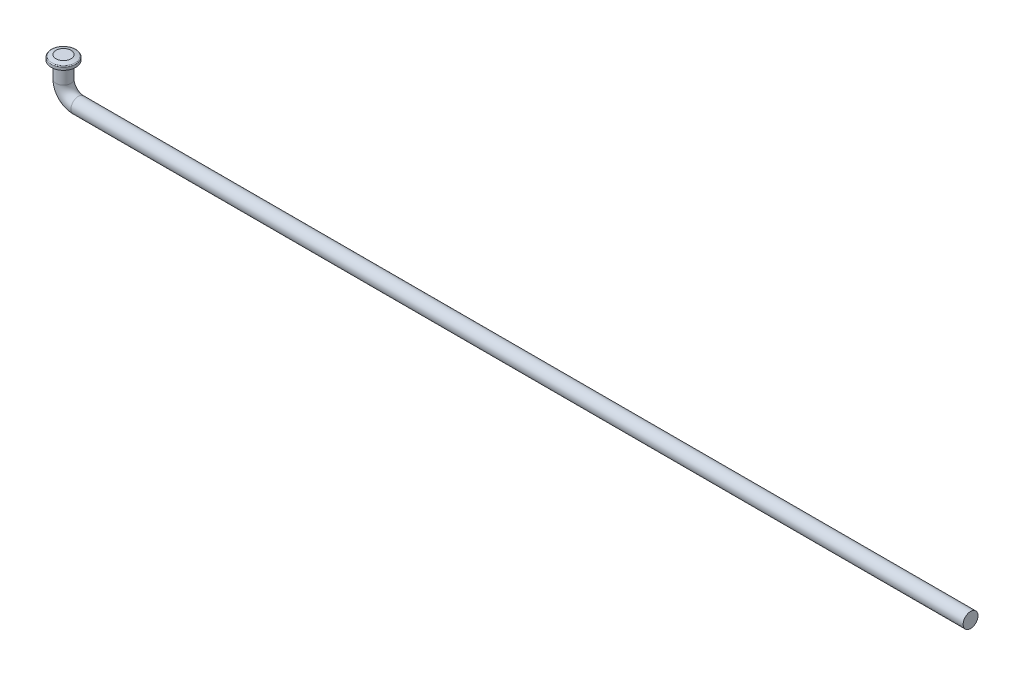
ISO-10303-21;
HEADER;
FILE_DESCRIPTION(('STEP AP214'),'2;1');
FILE_NAME('part.step','',(''),(''),'','','');
FILE_SCHEMA(('AUTOMOTIVE_DESIGN { 1 0 10303 214 1 1 1 1 }'));
ENDSEC;
DATA;
#1=APPLICATION_CONTEXT('core data for automotive mechanical design processes');
#2=APPLICATION_PROTOCOL_DEFINITION('international standard','automotive_design',2000,#1);
#3=PRODUCT_CONTEXT('',#1,'mechanical');
#4=PRODUCT('Part','Part','',(#3));
#5=PRODUCT_RELATED_PRODUCT_CATEGORY('part','',(#4));
#6=PRODUCT_DEFINITION_FORMATION('','',#4);
#7=PRODUCT_DEFINITION_CONTEXT('part definition',#1,'design');
#8=PRODUCT_DEFINITION('design','',#6,#7);
#9=PRODUCT_DEFINITION_SHAPE('','',#8);
#10=(LENGTH_UNIT() NAMED_UNIT(*) SI_UNIT(.MILLI.,.METRE.));
#11=(NAMED_UNIT(*) PLANE_ANGLE_UNIT() SI_UNIT($,.RADIAN.));
#12=(NAMED_UNIT(*) SI_UNIT($,.STERADIAN.) SOLID_ANGLE_UNIT());
#13=UNCERTAINTY_MEASURE_WITH_UNIT(LENGTH_MEASURE(1.E-05),#10,'distance_accuracy_value','');
#14=(GEOMETRIC_REPRESENTATION_CONTEXT(3) GLOBAL_UNCERTAINTY_ASSIGNED_CONTEXT((#13)) GLOBAL_UNIT_ASSIGNED_CONTEXT((#10,
#11,#12)) REPRESENTATION_CONTEXT('',''));
#15=CARTESIAN_POINT('',(0.,0.,0.));
#16=DIRECTION('',(0.,0.,1.));
#17=DIRECTION('',(1.,0.,0.));
#18=AXIS2_PLACEMENT_3D('',#15,#16,#17);
#19=CARTESIAN_POINT('',(-93.,6.85119386982182,0.));
#20=DIRECTION('',(0.,1.,0.));
#21=DIRECTION('',(-1.,0.,0.));
#22=AXIS2_PLACEMENT_3D('',#19,#20,#21);
#23=TOROIDAL_SURFACE('',#22,2.3,0.2);
#24=CARTESIAN_POINT('',(-93.,6.85119386982182,0.));
#25=DIRECTION('',(0.,1.,0.));
#26=DIRECTION('',(-1.,0.,0.));
#27=AXIS2_PLACEMENT_3D('',#24,#25,#26);
#28=CIRCLE('',#27,2.5);
#29=CARTESIAN_POINT('',(-95.5,6.85119386982182,0.));
#30=VERTEX_POINT('',#29);
#31=EDGE_CURVE('E55',#30,#30,#28,.F.);
#32=ORIENTED_EDGE('',*,*,#31,.F.);
#33=EDGE_LOOP('',(#32));
#34=FACE_BOUND('',#33,.T.);
#35=CARTESIAN_POINT('',(-93.,7.04275912686605,0.));
#36=DIRECTION('',(0.,-1.,0.));
#37=DIRECTION('',(0.,0.,-1.));
#38=AXIS2_PLACEMENT_3D('',#35,#36,#37);
#39=CIRCLE('',#38,2.35746957711326);
#40=CARTESIAN_POINT('',(-93.,7.04275912686605,-2.35746957711326));
#41=VERTEX_POINT('',#40);
#42=EDGE_CURVE('E12',#41,#41,#39,.F.);
#43=ORIENTED_EDGE('',*,*,#42,.F.);
#44=EDGE_LOOP('',(#43));
#45=FACE_BOUND('',#44,.T.);
#46=ADVANCED_FACE('F49',(#34,#45),#23,.T.);
#47=CARTESIAN_POINT('',(-93.,7.30000000000002,0.));
#48=DIRECTION('',(0.,-1.,0.));
#49=DIRECTION('',(1.,0.,0.));
#50=AXIS2_PLACEMENT_3D('',#47,#48,#49);
#51=CYLINDRICAL_SURFACE('',#50,2.5);
#52=ORIENTED_EDGE('',*,*,#31,.T.);
#53=EDGE_LOOP('',(#52));
#54=FACE_BOUND('',#53,.T.);
#55=CARTESIAN_POINT('',(-93.,6.30000000000002,0.));
#56=DIRECTION('',(0.,1.,0.));
#57=DIRECTION('',(0.,0.,1.));
#58=AXIS2_PLACEMENT_3D('',#55,#56,#57);
#59=CIRCLE('',#58,2.5);
#60=CARTESIAN_POINT('',(-93.,6.30000000000002,2.5));
#61=VERTEX_POINT('',#60);
#62=EDGE_CURVE('E63',#61,#61,#59,.T.);
#63=ORIENTED_EDGE('',*,*,#62,.T.);
#64=EDGE_LOOP('',(#63));
#65=FACE_BOUND('',#64,.T.);
#66=ADVANCED_FACE('F88',(#54,#65),#51,.T.);
#67=CARTESIAN_POINT('',(-93.,7.30000000000002,0.));
#68=DIRECTION('',(0.,1.,0.));
#69=DIRECTION('',(-1.,0.,0.));
#70=AXIS2_PLACEMENT_3D('',#67,#68,#69);
#71=PLANE('',#70);
#72=CARTESIAN_POINT('',(-93.,7.30000000000002,0.));
#73=DIRECTION('',(0.,1.,0.));
#74=DIRECTION('',(-1.,0.,0.));
#75=AXIS2_PLACEMENT_3D('',#72,#73,#74);
#76=CIRCLE('',#75,1.5);
#77=CARTESIAN_POINT('',(-94.5,7.30000000000002,0.));
#78=VERTEX_POINT('',#77);
#79=EDGE_CURVE('E68',#78,#78,#76,.T.);
#80=ORIENTED_EDGE('',*,*,#79,.T.);
#81=EDGE_LOOP('',(#80));
#82=FACE_BOUND('',#81,.T.);
#83=ADVANCED_FACE('F72',(#82),#71,.T.);
#84=CARTESIAN_POINT('',(-93.,6.00000000000002,0.));
#85=DIRECTION('',(0.,1.,0.));
#86=DIRECTION('',(-1.,0.,0.));
#87=AXIS2_PLACEMENT_3D('',#84,#85,#86);
#88=PLANE('',#87);
#89=CARTESIAN_POINT('',(-93.,6.00000000000002,0.));
#90=DIRECTION('',(0.,1.,0.));
#91=DIRECTION('',(-1.,0.,0.));
#92=AXIS2_PLACEMENT_3D('',#89,#90,#91);
#93=CIRCLE('',#92,1.71847328059185);
#94=CARTESIAN_POINT('',(-94.7184732805919,6.00000000000002,0.));
#95=VERTEX_POINT('',#94);
#96=EDGE_CURVE('E59',#95,#95,#93,.F.);
#97=ORIENTED_EDGE('',*,*,#96,.T.);
#98=EDGE_LOOP('',(#97));
#99=FACE_BOUND('',#98,.T.);
#100=ADVANCED_FACE('F77',(#99),#88,.F.);
#101=CARTESIAN_POINT('',(-93.,7.30000000000002,0.));
#102=DIRECTION('',(0.,-1.,0.));
#103=DIRECTION('',(0.,0.,-1.));
#104=AXIS2_PLACEMENT_3D('',#101,#102,#103);
#105=CONICAL_SURFACE('',#104,1.5,1.27933953231703);
#106=ORIENTED_EDGE('',*,*,#42,.T.);
#107=EDGE_LOOP('',(#106));
#108=FACE_BOUND('',#107,.T.);
#109=ORIENTED_EDGE('',*,*,#79,.F.);
#110=EDGE_LOOP('',(#109));
#111=FACE_BOUND('',#110,.T.);
#112=ADVANCED_FACE('F74',(#108,#111),#105,.T.);
#113=CARTESIAN_POINT('',(-93.,6.30000000000002,0.));
#114=DIRECTION('',(0.,1.,0.));
#115=DIRECTION('',(0.,0.,1.));
#116=AXIS2_PLACEMENT_3D('',#113,#114,#115);
#117=CONICAL_SURFACE('',#116,2.5,1.20427718387609);
#118=ORIENTED_EDGE('',*,*,#96,.F.);
#119=EDGE_LOOP('',(#118));
#120=FACE_BOUND('',#119,.T.);
#121=ORIENTED_EDGE('',*,*,#62,.F.);
#122=EDGE_LOOP('',(#121));
#123=FACE_BOUND('',#122,.T.);
#124=ADVANCED_FACE('F76',(#120,#123),#117,.T.);
#125=CLOSED_SHELL('',(#46,#66,#83,#100,#112,#124));
#126=MANIFOLD_SOLID_BREP('B2',#125);
#127=CARTESIAN_POINT('',(-93.,3.00000000000001,0.));
#128=DIRECTION('',(0.,1.,0.));
#129=DIRECTION('',(0.,0.,1.));
#130=AXIS2_PLACEMENT_3D('',#127,#128,#129);
#131=CYLINDRICAL_SURFACE('',#130,1.5);
#132=CARTESIAN_POINT('',(-93.,6.00000000000001,0.));
#133=DIRECTION('',(0.,-1.,0.));
#134=DIRECTION('',(1.,0.,0.));
#135=AXIS2_PLACEMENT_3D('',#132,#133,#134);
#136=CIRCLE('',#135,1.5);
#137=CARTESIAN_POINT('',(-91.5,6.00000000000001,0.));
#138=VERTEX_POINT('',#137);
#139=EDGE_CURVE('E140',#138,#138,#136,.T.);
#140=ORIENTED_EDGE('',*,*,#139,.T.);
#141=EDGE_LOOP('',(#140));
#142=FACE_BOUND('',#141,.T.);
#143=CARTESIAN_POINT('',(-93.,3.,0.));
#144=DIRECTION('',(0.,-1.,0.));
#145=DIRECTION('',(1.,0.,0.));
#146=AXIS2_PLACEMENT_3D('',#143,#144,#145);
#147=CIRCLE('',#146,1.5);
#148=CARTESIAN_POINT('',(-94.5,3.,0.));
#149=VERTEX_POINT('',#148);
#150=EDGE_CURVE('E48',#149,#149,#147,.T.);
#151=ORIENTED_EDGE('',*,*,#150,.F.);
#152=EDGE_LOOP('',(#151));
#153=FACE_BOUND('',#152,.T.);
#154=ADVANCED_FACE('F134',(#142,#153),#131,.T.);
#155=CARTESIAN_POINT('',(-93.,6.00000000000001,0.));
#156=DIRECTION('',(0.,-1.,0.));
#157=DIRECTION('',(1.,0.,0.));
#158=AXIS2_PLACEMENT_3D('',#155,#156,#157);
#159=PLANE('',#158);
#160=ORIENTED_EDGE('',*,*,#139,.F.);
#161=EDGE_LOOP('',(#160));
#162=FACE_BOUND('',#161,.T.);
#163=ADVANCED_FACE('F164',(#162),#159,.F.);
#164=CARTESIAN_POINT('',(-90.,3.,0.));
#165=DIRECTION('',(0.,0.,-1.));
#166=DIRECTION('',(-1.,0.,0.));
#167=AXIS2_PLACEMENT_3D('',#164,#165,#166);
#168=TOROIDAL_SURFACE('',#167,3.,1.5);
#169=CARTESIAN_POINT('',(-90.,0.,0.));
#170=DIRECTION('',(1.,0.,0.));
#171=DIRECTION('',(0.,1.,0.));
#172=AXIS2_PLACEMENT_3D('',#169,#170,#171);
#173=CIRCLE('',#172,1.5);
#174=CARTESIAN_POINT('',(-90.,-1.5,0.));
#175=VERTEX_POINT('',#174);
#176=EDGE_CURVE('E144',#175,#175,#173,.T.);
#177=CARTESIAN_POINT('',(-90.,3.,0.));
#178=DIRECTION('',(0.,0.,-1.));
#179=DIRECTION('',(-1.,0.,0.));
#180=AXIS2_PLACEMENT_3D('',#177,#178,#179);
#181=CIRCLE('',#180,4.5);
#182=EDGE_CURVE('',#175,#149,#181,.T.);
#183=ORIENTED_EDGE('',*,*,#176,.F.);
#184=ORIENTED_EDGE('',*,*,#150,.T.);
#185=ORIENTED_EDGE('',*,*,#182,.T.);
#186=ORIENTED_EDGE('',*,*,#182,.F.);
#187=EDGE_LOOP('',(#183,#185,#184,#186));
#188=FACE_BOUND('',#187,.T.);
#189=ADVANCED_FACE('F159',(#188),#168,.T.);
#190=CARTESIAN_POINT('',(90.,0.,0.));
#191=DIRECTION('',(-1.,0.,0.));
#192=DIRECTION('',(0.,-1.,0.));
#193=AXIS2_PLACEMENT_3D('',#190,#191,#192);
#194=CYLINDRICAL_SURFACE('',#193,1.5);
#195=CARTESIAN_POINT('',(90.,0.,0.));
#196=DIRECTION('',(1.,0.,0.));
#197=DIRECTION('',(0.,1.,0.));
#198=AXIS2_PLACEMENT_3D('',#195,#196,#197);
#199=CIRCLE('',#198,1.5);
#200=CARTESIAN_POINT('',(90.,-1.49999999999997,0.));
#201=VERTEX_POINT('',#200);
#202=EDGE_CURVE('E148',#201,#201,#199,.T.);
#203=CARTESIAN_POINT('',(90.,-1.49999999999997,0.));
#204=CARTESIAN_POINT('',(88.125,-1.49999999999997,0.));
#205=CARTESIAN_POINT('',(86.25,-1.49999999999997,0.));
#206=CARTESIAN_POINT('',(82.5,-1.49999999999997,0.));
#207=CARTESIAN_POINT('',(80.625,-1.49999999999997,0.));
#208=CARTESIAN_POINT('',(76.875,-1.49999999999997,0.));
#209=CARTESIAN_POINT('',(75.,-1.49999999999997,0.));
#210=CARTESIAN_POINT('',(71.25,-1.49999999999997,0.));
#211=CARTESIAN_POINT('',(69.375,-1.49999999999997,0.));
#212=CARTESIAN_POINT('',(65.625,-1.49999999999997,0.));
#213=CARTESIAN_POINT('',(63.75,-1.49999999999997,0.));
#214=CARTESIAN_POINT('',(60.,-1.49999999999997,0.));
#215=CARTESIAN_POINT('',(58.125,-1.49999999999997,0.));
#216=CARTESIAN_POINT('',(54.375,-1.49999999999997,0.));
#217=CARTESIAN_POINT('',(52.5,-1.49999999999997,0.));
#218=CARTESIAN_POINT('',(48.75,-1.49999999999997,0.));
#219=CARTESIAN_POINT('',(46.875,-1.49999999999998,0.));
#220=CARTESIAN_POINT('',(43.125,-1.49999999999998,0.));
#221=CARTESIAN_POINT('',(41.25,-1.49999999999998,0.));
#222=CARTESIAN_POINT('',(37.5,-1.49999999999998,0.));
#223=CARTESIAN_POINT('',(35.625,-1.49999999999998,0.));
#224=CARTESIAN_POINT('',(31.875,-1.49999999999998,0.));
#225=CARTESIAN_POINT('',(30.,-1.49999999999998,0.));
#226=CARTESIAN_POINT('',(26.25,-1.49999999999998,0.));
#227=CARTESIAN_POINT('',(24.375,-1.49999999999998,0.));
#228=CARTESIAN_POINT('',(20.625,-1.49999999999998,0.));
#229=CARTESIAN_POINT('',(18.75,-1.49999999999998,0.));
#230=CARTESIAN_POINT('',(15.,-1.49999999999998,0.));
#231=CARTESIAN_POINT('',(13.125,-1.49999999999998,0.));
#232=CARTESIAN_POINT('',(9.37500000000003,-1.49999999999998,0.));
#233=CARTESIAN_POINT('',(7.50000000000003,-1.49999999999998,0.));
#234=CARTESIAN_POINT('',(3.75000000000003,-1.49999999999998,0.));
#235=CARTESIAN_POINT('',(1.87500000000003,-1.49999999999998,0.));
#236=CARTESIAN_POINT('',(-1.87499999999997,-1.49999999999998,0.));
#237=CARTESIAN_POINT('',(-3.74999999999998,-1.49999999999998,0.));
#238=CARTESIAN_POINT('',(-7.49999999999997,-1.49999999999999,0.));
#239=CARTESIAN_POINT('',(-9.37499999999997,-1.49999999999999,0.));
#240=CARTESIAN_POINT('',(-13.125,-1.49999999999999,0.));
#241=CARTESIAN_POINT('',(-15.,-1.49999999999999,0.));
#242=CARTESIAN_POINT('',(-18.75,-1.49999999999999,0.));
#243=CARTESIAN_POINT('',(-20.625,-1.49999999999999,0.));
#244=CARTESIAN_POINT('',(-24.375,-1.49999999999999,0.));
#245=CARTESIAN_POINT('',(-26.25,-1.49999999999999,0.));
#246=CARTESIAN_POINT('',(-30.,-1.49999999999999,0.));
#247=CARTESIAN_POINT('',(-31.875,-1.49999999999999,0.));
#248=CARTESIAN_POINT('',(-35.625,-1.49999999999999,0.));
#249=CARTESIAN_POINT('',(-37.5,-1.49999999999999,0.));
#250=CARTESIAN_POINT('',(-41.25,-1.49999999999999,0.));
#251=CARTESIAN_POINT('',(-43.125,-1.49999999999999,0.));
#252=CARTESIAN_POINT('',(-46.875,-1.49999999999999,0.));
#253=CARTESIAN_POINT('',(-48.75,-1.49999999999999,0.));
#254=CARTESIAN_POINT('',(-52.5,-1.49999999999999,0.));
#255=CARTESIAN_POINT('',(-54.375,-1.49999999999999,0.));
#256=CARTESIAN_POINT('',(-58.125,-1.49999999999999,0.));
#257=CARTESIAN_POINT('',(-60.,-1.5,0.));
#258=CARTESIAN_POINT('',(-63.75,-1.5,0.));
#259=CARTESIAN_POINT('',(-65.625,-1.5,0.));
#260=CARTESIAN_POINT('',(-69.375,-1.5,0.));
#261=CARTESIAN_POINT('',(-71.25,-1.5,0.));
#262=CARTESIAN_POINT('',(-75.,-1.5,0.));
#263=CARTESIAN_POINT('',(-76.875,-1.5,0.));
#264=CARTESIAN_POINT('',(-80.625,-1.5,0.));
#265=CARTESIAN_POINT('',(-82.5,-1.5,0.));
#266=CARTESIAN_POINT('',(-86.25,-1.5,0.));
#267=CARTESIAN_POINT('',(-88.125,-1.5,0.));
#268=CARTESIAN_POINT('',(-90.,-1.5,0.));
#269=B_SPLINE_CURVE_WITH_KNOTS('',3,(#203,#204,#205,#206,#207,#208,#209,#210,#211,#212,#213,
#214,#215,#216,#217,#218,#219,#220,#221,#222,#223,#224,#225,#226,#227,#228,#229,#230,#231,#232,
#233,#234,#235,#236,#237,#238,#239,#240,#241,#242,#243,#244,#245,#246,#247,#248,#249,#250,#251,
#252,#253,#254,#255,#256,#257,#258,#259,#260,#261,#262,#263,#264,#265,#266,#267,#268),
.UNSPECIFIED.,.F.,.F.,(4,2,2,2,2,2,2,2,2,2,2,2,2,2,2,2,2,2,2,2,2,2,2,2,2,2,2,2,2,2,2,2,4),(0.,
5.62500000000001,11.25,16.875,22.5,28.125,33.75,39.375,45.,50.625,56.25,61.875,67.5,73.125,
78.75,84.375,90.,95.625,101.25,106.875,112.5,118.125,123.75,129.375,135.,140.625,146.25,151.875,
157.5,163.125,168.75,174.375,180.),.UNSPECIFIED.);
#270=EDGE_CURVE('BSEAM156',#201,#175,#269,.T.);
#271=ORIENTED_EDGE('',*,*,#202,.F.);
#272=ORIENTED_EDGE('',*,*,#176,.T.);
#273=ORIENTED_EDGE('',*,*,#270,.T.);
#274=ORIENTED_EDGE('',*,*,#270,.F.);
#275=EDGE_LOOP('',(#271,#273,#272,#274));
#276=FACE_BOUND('',#275,.T.);
#277=ADVANCED_FACE('F156',(#276),#194,.T.);
#278=CARTESIAN_POINT('',(90.,0.,0.));
#279=DIRECTION('',(1.,0.,0.));
#280=DIRECTION('',(0.,1.,0.));
#281=AXIS2_PLACEMENT_3D('',#278,#279,#280);
#282=PLANE('',#281);
#283=ORIENTED_EDGE('',*,*,#202,.T.);
#284=EDGE_LOOP('',(#283));
#285=FACE_BOUND('',#284,.T.);
#286=ADVANCED_FACE('F154',(#285),#282,.T.);
#287=CLOSED_SHELL('',(#154,#163,#189,#277,#286));
#288=MANIFOLD_SOLID_BREP('B7',#287);
#289=ADVANCED_BREP_SHAPE_REPRESENTATION('',(#18,#126,#288),#14);
#290=SHAPE_DEFINITION_REPRESENTATION(#9,#289);
ENDSEC;
END-ISO-10303-21;
